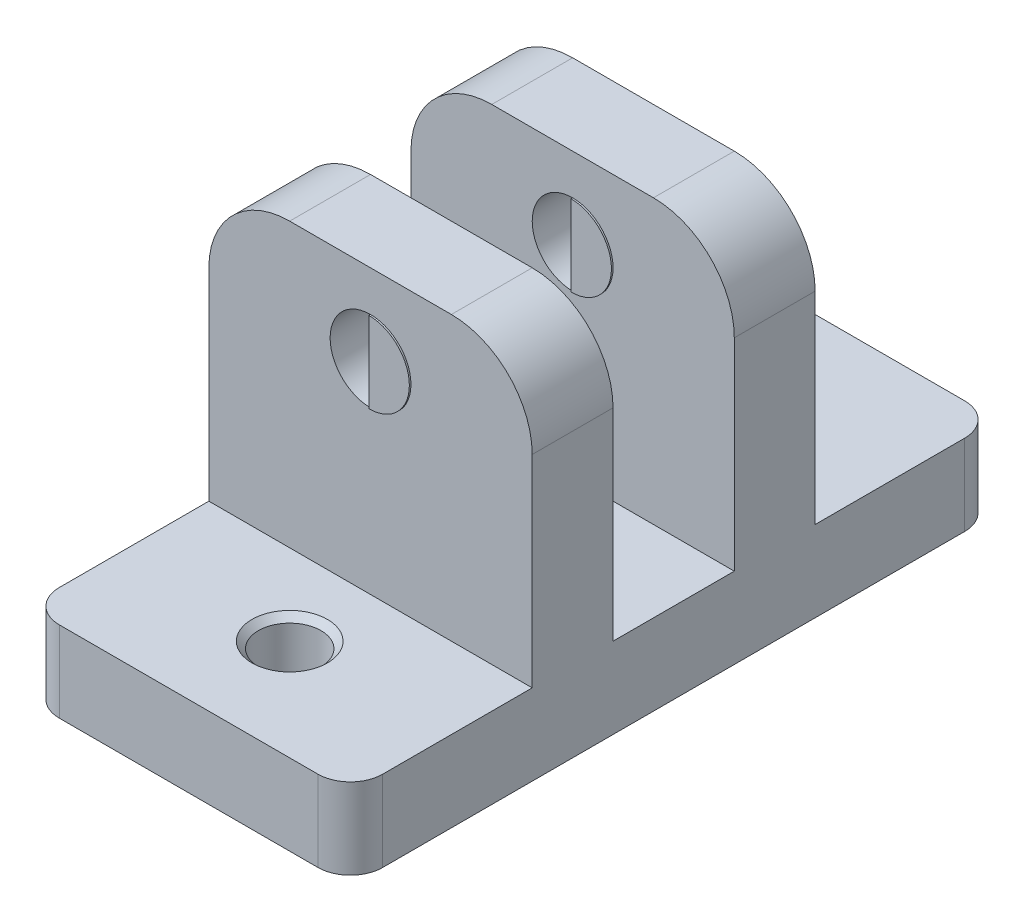
ISO-10303-21;
HEADER;
FILE_DESCRIPTION(('STEP AP214'),'2;1');
FILE_NAME('part.step','',(''),(''),'','','');
FILE_SCHEMA(('AUTOMOTIVE_DESIGN { 1 0 10303 214 1 1 1 1 }'));
ENDSEC;
DATA;
#1=APPLICATION_CONTEXT('core data for automotive mechanical design processes');
#2=APPLICATION_PROTOCOL_DEFINITION('international standard','automotive_design',2000,#1);
#3=PRODUCT_CONTEXT('',#1,'mechanical');
#4=PRODUCT('Part','Part','',(#3));
#5=PRODUCT_RELATED_PRODUCT_CATEGORY('part','',(#4));
#6=PRODUCT_DEFINITION_FORMATION('','',#4);
#7=PRODUCT_DEFINITION_CONTEXT('part definition',#1,'design');
#8=PRODUCT_DEFINITION('design','',#6,#7);
#9=PRODUCT_DEFINITION_SHAPE('','',#8);
#10=(LENGTH_UNIT() NAMED_UNIT(*) SI_UNIT(.MILLI.,.METRE.));
#11=(NAMED_UNIT(*) PLANE_ANGLE_UNIT() SI_UNIT($,.RADIAN.));
#12=(NAMED_UNIT(*) SI_UNIT($,.STERADIAN.) SOLID_ANGLE_UNIT());
#13=UNCERTAINTY_MEASURE_WITH_UNIT(LENGTH_MEASURE(1.E-05),#10,'distance_accuracy_value','');
#14=(GEOMETRIC_REPRESENTATION_CONTEXT(3) GLOBAL_UNCERTAINTY_ASSIGNED_CONTEXT((#13)) GLOBAL_UNIT_ASSIGNED_CONTEXT((#10,
#11,#12)) REPRESENTATION_CONTEXT('',''));
#15=CARTESIAN_POINT('',(0.,0.,0.));
#16=DIRECTION('',(0.,0.,1.));
#17=DIRECTION('',(1.,0.,0.));
#18=AXIS2_PLACEMENT_3D('',#15,#16,#17);
#19=CARTESIAN_POINT('',(0.,22.225,25.4));
#20=DIRECTION('',(0.,0.,-1.));
#21=DIRECTION('',(0.,1.,0.));
#22=AXIS2_PLACEMENT_3D('',#19,#20,#21);
#23=CYLINDRICAL_SURFACE('',#22,3.175);
#24=DIRECTION('',(0.,0.,-1.));
#25=VECTOR('',#24,1.);
#26=CARTESIAN_POINT('',(0.,19.05,25.4));
#27=LINE('',#26,#25);
#28=CARTESIAN_POINT('',(0.,19.05,4.7625));
#29=VERTEX_POINT('',#28);
#30=CARTESIAN_POINT('',(0.,19.05,11.1125));
#31=VERTEX_POINT('',#30);
#32=EDGE_CURVE('E12',#29,#31,#27,.F.);
#33=ORIENTED_EDGE('',*,*,#32,.F.);
#34=CARTESIAN_POINT('',(0.,22.225,4.7625));
#35=DIRECTION('',(0.,0.,1.));
#36=DIRECTION('',(0.,-1.,0.));
#37=AXIS2_PLACEMENT_3D('',#34,#35,#36);
#38=CIRCLE('',#37,3.175);
#39=CARTESIAN_POINT('',(0.,25.4,4.7625));
#40=VERTEX_POINT('',#39);
#41=EDGE_CURVE('E283',#40,#29,#38,.T.);
#42=ORIENTED_EDGE('',*,*,#41,.F.);
#43=DIRECTION('',(0.,0.,-1.));
#44=VECTOR('',#43,1.);
#45=CARTESIAN_POINT('',(0.,25.4,25.4));
#46=LINE('',#45,#44);
#47=CARTESIAN_POINT('',(0.,25.4,11.1125));
#48=VERTEX_POINT('',#47);
#49=EDGE_CURVE('E51',#48,#40,#46,.T.);
#50=ORIENTED_EDGE('',*,*,#49,.F.);
#51=CARTESIAN_POINT('',(0.,22.225,11.1125));
#52=DIRECTION('',(0.,0.,-1.));
#53=DIRECTION('',(0.,1.,0.));
#54=AXIS2_PLACEMENT_3D('',#51,#52,#53);
#55=CIRCLE('',#54,3.175);
#56=EDGE_CURVE('E58',#31,#48,#55,.T.);
#57=ORIENTED_EDGE('',*,*,#56,.F.);
#58=EDGE_LOOP('',(#33,#42,#50,#57));
#59=FACE_BOUND('',#58,.T.);
#60=ADVANCED_FACE('F43',(#59),#23,.F.);
#61=CARTESIAN_POINT('',(0.,28.575,0.));
#62=DIRECTION('',(0.,-1.,0.));
#63=DIRECTION('',(0.,0.,-1.));
#64=AXIS2_PLACEMENT_3D('',#61,#62,#63);
#65=PLANE('',#64);
#66=DIRECTION('',(1.,0.,0.));
#67=VECTOR('',#66,1.);
#68=CARTESIAN_POINT('',(-12.7,28.575,11.1125));
#69=LINE('',#68,#67);
#70=CARTESIAN_POINT('',(-6.35,28.575,11.1125));
#71=VERTEX_POINT('',#70);
#72=CARTESIAN_POINT('',(6.35,28.575,11.1125));
#73=VERTEX_POINT('',#72);
#74=EDGE_CURVE('E334',#71,#73,#69,.T.);
#75=ORIENTED_EDGE('',*,*,#74,.T.);
#76=DIRECTION('',(0.,0.,-1.));
#77=VECTOR('',#76,1.);
#78=CARTESIAN_POINT('',(6.35,28.575,0.));
#79=LINE('',#78,#77);
#80=CARTESIAN_POINT('',(6.35,28.575,4.7625));
#81=VERTEX_POINT('',#80);
#82=EDGE_CURVE('E358',#73,#81,#79,.T.);
#83=ORIENTED_EDGE('',*,*,#82,.T.);
#84=DIRECTION('',(1.,0.,0.));
#85=VECTOR('',#84,1.);
#86=CARTESIAN_POINT('',(-12.7,28.575,4.7625));
#87=LINE('',#86,#85);
#88=CARTESIAN_POINT('',(-6.35,28.575,4.7625));
#89=VERTEX_POINT('',#88);
#90=EDGE_CURVE('E297',#89,#81,#87,.T.);
#91=ORIENTED_EDGE('',*,*,#90,.F.);
#92=DIRECTION('',(0.,0.,1.));
#93=VECTOR('',#92,1.);
#94=CARTESIAN_POINT('',(-6.35,28.575,0.));
#95=LINE('',#94,#93);
#96=EDGE_CURVE('E355',#89,#71,#95,.T.);
#97=ORIENTED_EDGE('',*,*,#96,.T.);
#98=EDGE_LOOP('',(#75,#83,#91,#97));
#99=FACE_BOUND('',#98,.T.);
#100=ADVANCED_FACE('F576',(#99),#65,.F.);
#101=CARTESIAN_POINT('',(12.7,28.575,25.4));
#102=DIRECTION('',(-1.,0.,0.));
#103=DIRECTION('',(0.,0.,1.));
#104=AXIS2_PLACEMENT_3D('',#101,#102,#103);
#105=PLANE('',#104);
#106=DIRECTION('',(0.,0.,-1.));
#107=VECTOR('',#106,1.);
#108=CARTESIAN_POINT('',(12.7,6.35,25.4));
#109=LINE('',#108,#107);
#110=CARTESIAN_POINT('',(12.7,6.35,22.86));
#111=VERTEX_POINT('',#110);
#112=CARTESIAN_POINT('',(12.7,6.35,11.1125));
#113=VERTEX_POINT('',#112);
#114=EDGE_CURVE('E303',#111,#113,#109,.T.);
#115=ORIENTED_EDGE('',*,*,#114,.F.);
#116=DIRECTION('',(0.,-1.,0.));
#117=VECTOR('',#116,1.);
#118=CARTESIAN_POINT('',(12.7,28.575,22.86));
#119=LINE('',#118,#117);
#120=CARTESIAN_POINT('',(12.7,0.,22.86));
#121=VERTEX_POINT('',#120);
#122=EDGE_CURVE('E393',#111,#121,#119,.T.);
#123=ORIENTED_EDGE('',*,*,#122,.T.);
#124=DIRECTION('',(0.,0.,-1.));
#125=VECTOR('',#124,1.);
#126=CARTESIAN_POINT('',(12.7,0.,25.4));
#127=LINE('',#126,#125);
#128=CARTESIAN_POINT('',(12.7,0.,-22.86));
#129=VERTEX_POINT('',#128);
#130=EDGE_CURVE('E337',#121,#129,#127,.T.);
#131=ORIENTED_EDGE('',*,*,#130,.T.);
#132=DIRECTION('',(0.,-1.,0.));
#133=VECTOR('',#132,1.);
#134=CARTESIAN_POINT('',(12.7,28.575,-22.86));
#135=LINE('',#134,#133);
#136=CARTESIAN_POINT('',(12.7,6.35,-22.86));
#137=VERTEX_POINT('',#136);
#138=EDGE_CURVE('E391',#129,#137,#135,.F.);
#139=ORIENTED_EDGE('',*,*,#138,.T.);
#140=DIRECTION('',(0.,0.,-1.));
#141=VECTOR('',#140,1.);
#142=CARTESIAN_POINT('',(12.7,6.35,-25.4));
#143=LINE('',#142,#141);
#144=CARTESIAN_POINT('',(12.7,6.35,-11.1125));
#145=VERTEX_POINT('',#144);
#146=EDGE_CURVE('E291',#145,#137,#143,.T.);
#147=ORIENTED_EDGE('',*,*,#146,.F.);
#148=DIRECTION('',(0.,-1.,0.));
#149=VECTOR('',#148,1.);
#150=CARTESIAN_POINT('',(12.7,28.575,-11.1125));
#151=LINE('',#150,#149);
#152=CARTESIAN_POINT('',(12.7,22.225,-11.1125));
#153=VERTEX_POINT('',#152);
#154=EDGE_CURVE('E295',#153,#145,#151,.T.);
#155=ORIENTED_EDGE('',*,*,#154,.F.);
#156=DIRECTION('',(0.,0.,-1.));
#157=VECTOR('',#156,1.);
#158=CARTESIAN_POINT('',(12.7,22.225,25.4));
#159=LINE('',#158,#157);
#160=CARTESIAN_POINT('',(12.7,22.225,-4.7625));
#161=VERTEX_POINT('',#160);
#162=EDGE_CURVE('E365',#153,#161,#159,.F.);
#163=ORIENTED_EDGE('',*,*,#162,.T.);
#164=DIRECTION('',(0.,1.,0.));
#165=VECTOR('',#164,1.);
#166=CARTESIAN_POINT('',(12.7,28.575,-4.7625));
#167=LINE('',#166,#165);
#168=CARTESIAN_POINT('',(12.7,6.35,-4.7625));
#169=VERTEX_POINT('',#168);
#170=EDGE_CURVE('E481',#169,#161,#167,.T.);
#171=ORIENTED_EDGE('',*,*,#170,.F.);
#172=DIRECTION('',(0.,0.,-1.));
#173=VECTOR('',#172,1.);
#174=CARTESIAN_POINT('',(12.7,6.35,4.76249999999999));
#175=LINE('',#174,#173);
#176=CARTESIAN_POINT('',(12.7,6.35,4.76249999999999));
#177=VERTEX_POINT('',#176);
#178=EDGE_CURVE('E485',#177,#169,#175,.T.);
#179=ORIENTED_EDGE('',*,*,#178,.F.);
#180=DIRECTION('',(0.,-1.,0.));
#181=VECTOR('',#180,1.);
#182=CARTESIAN_POINT('',(12.7,28.575,4.7625));
#183=LINE('',#182,#181);
#184=CARTESIAN_POINT('',(12.7,22.225,4.7625));
#185=VERTEX_POINT('',#184);
#186=EDGE_CURVE('E287',#185,#177,#183,.T.);
#187=ORIENTED_EDGE('',*,*,#186,.F.);
#188=DIRECTION('',(0.,0.,-1.));
#189=VECTOR('',#188,1.);
#190=CARTESIAN_POINT('',(12.7,22.225,25.4));
#191=LINE('',#190,#189);
#192=CARTESIAN_POINT('',(12.7,22.225,11.1125));
#193=VERTEX_POINT('',#192);
#194=EDGE_CURVE('E367',#185,#193,#191,.F.);
#195=ORIENTED_EDGE('',*,*,#194,.T.);
#196=DIRECTION('',(0.,1.,0.));
#197=VECTOR('',#196,1.);
#198=CARTESIAN_POINT('',(12.7,28.575,11.1125));
#199=LINE('',#198,#197);
#200=EDGE_CURVE('E327',#113,#193,#199,.T.);
#201=ORIENTED_EDGE('',*,*,#200,.F.);
#202=EDGE_LOOP('',(#115,#123,#131,#139,#147,#155,#163,#171,#179,#187,#195,#201));
#203=FACE_BOUND('',#202,.T.);
#204=ADVANCED_FACE('F527',(#203),#105,.F.);
#205=CARTESIAN_POINT('',(-12.7,28.575,-25.4));
#206=DIRECTION('',(0.,0.,1.));
#207=DIRECTION('',(1.,0.,0.));
#208=AXIS2_PLACEMENT_3D('',#205,#206,#207);
#209=PLANE('',#208);
#210=DIRECTION('',(1.,0.,0.));
#211=VECTOR('',#210,1.);
#212=CARTESIAN_POINT('',(-12.7,6.35,-25.4));
#213=LINE('',#212,#211);
#214=CARTESIAN_POINT('',(-10.16,6.35,-25.4));
#215=VERTEX_POINT('',#214);
#216=CARTESIAN_POINT('',(10.16,6.35,-25.4));
#217=VERTEX_POINT('',#216);
#218=EDGE_CURVE('E300',#215,#217,#213,.T.);
#219=ORIENTED_EDGE('',*,*,#218,.T.);
#220=DIRECTION('',(0.,-1.,0.));
#221=VECTOR('',#220,1.);
#222=CARTESIAN_POINT('',(10.16,28.575,-25.4));
#223=LINE('',#222,#221);
#224=CARTESIAN_POINT('',(10.16,0.,-25.4));
#225=VERTEX_POINT('',#224);
#226=EDGE_CURVE('E415',#217,#225,#223,.T.);
#227=ORIENTED_EDGE('',*,*,#226,.T.);
#228=DIRECTION('',(-1.,0.,0.));
#229=VECTOR('',#228,1.);
#230=CARTESIAN_POINT('',(-12.7,0.,-25.4));
#231=LINE('',#230,#229);
#232=CARTESIAN_POINT('',(-10.16,0.,-25.4));
#233=VERTEX_POINT('',#232);
#234=EDGE_CURVE('E346',#225,#233,#231,.T.);
#235=ORIENTED_EDGE('',*,*,#234,.T.);
#236=DIRECTION('',(0.,-1.,0.));
#237=VECTOR('',#236,1.);
#238=CARTESIAN_POINT('',(-10.16,28.575,-25.4));
#239=LINE('',#238,#237);
#240=EDGE_CURVE('E413',#233,#215,#239,.F.);
#241=ORIENTED_EDGE('',*,*,#240,.T.);
#242=EDGE_LOOP('',(#219,#227,#235,#241));
#243=FACE_BOUND('',#242,.T.);
#244=ADVANCED_FACE('F539',(#243),#209,.F.);
#245=CARTESIAN_POINT('',(-12.7,28.575,25.4));
#246=DIRECTION('',(1.,0.,0.));
#247=DIRECTION('',(0.,0.,-1.));
#248=AXIS2_PLACEMENT_3D('',#245,#246,#247);
#249=PLANE('',#248);
#250=DIRECTION('',(0.,0.,1.));
#251=VECTOR('',#250,1.);
#252=CARTESIAN_POINT('',(-12.7,0.,25.4));
#253=LINE('',#252,#251);
#254=CARTESIAN_POINT('',(-12.7,0.,-22.86));
#255=VERTEX_POINT('',#254);
#256=CARTESIAN_POINT('',(-12.7,0.,22.86));
#257=VERTEX_POINT('',#256);
#258=EDGE_CURVE('E349',#255,#257,#253,.T.);
#259=ORIENTED_EDGE('',*,*,#258,.T.);
#260=DIRECTION('',(0.,-1.,0.));
#261=VECTOR('',#260,1.);
#262=CARTESIAN_POINT('',(-12.7,28.575,22.86));
#263=LINE('',#262,#261);
#264=CARTESIAN_POINT('',(-12.7,6.35,22.86));
#265=VERTEX_POINT('',#264);
#266=EDGE_CURVE('E425',#257,#265,#263,.F.);
#267=ORIENTED_EDGE('',*,*,#266,.T.);
#268=DIRECTION('',(0.,0.,-1.));
#269=VECTOR('',#268,1.);
#270=CARTESIAN_POINT('',(-12.7,6.35,25.4));
#271=LINE('',#270,#269);
#272=CARTESIAN_POINT('',(-12.7,6.35,11.1125));
#273=VERTEX_POINT('',#272);
#274=EDGE_CURVE('E324',#265,#273,#271,.T.);
#275=ORIENTED_EDGE('',*,*,#274,.T.);
#276=DIRECTION('',(0.,1.,0.));
#277=VECTOR('',#276,1.);
#278=CARTESIAN_POINT('',(-12.7,28.575,11.1125));
#279=LINE('',#278,#277);
#280=CARTESIAN_POINT('',(-12.7,22.225,11.1125));
#281=VERTEX_POINT('',#280);
#282=EDGE_CURVE('E326',#273,#281,#279,.T.);
#283=ORIENTED_EDGE('',*,*,#282,.T.);
#284=DIRECTION('',(0.,0.,1.));
#285=VECTOR('',#284,1.);
#286=CARTESIAN_POINT('',(-12.7,22.225,25.4));
#287=LINE('',#286,#285);
#288=CARTESIAN_POINT('',(-12.7,22.225,4.7625));
#289=VERTEX_POINT('',#288);
#290=EDGE_CURVE('E387',#281,#289,#287,.F.);
#291=ORIENTED_EDGE('',*,*,#290,.T.);
#292=DIRECTION('',(0.,-1.,0.));
#293=VECTOR('',#292,1.);
#294=CARTESIAN_POINT('',(-12.7,28.575,4.7625));
#295=LINE('',#294,#293);
#296=CARTESIAN_POINT('',(-12.7,6.35,4.76249999999999));
#297=VERTEX_POINT('',#296);
#298=EDGE_CURVE('E484',#289,#297,#295,.T.);
#299=ORIENTED_EDGE('',*,*,#298,.T.);
#300=DIRECTION('',(0.,0.,-1.));
#301=VECTOR('',#300,1.);
#302=CARTESIAN_POINT('',(-12.7,6.35,4.76249999999999));
#303=LINE('',#302,#301);
#304=CARTESIAN_POINT('',(-12.7,6.35,-4.7625));
#305=VERTEX_POINT('',#304);
#306=EDGE_CURVE('E491',#297,#305,#303,.T.);
#307=ORIENTED_EDGE('',*,*,#306,.T.);
#308=DIRECTION('',(0.,1.,0.));
#309=VECTOR('',#308,1.);
#310=CARTESIAN_POINT('',(-12.7,28.575,-4.7625));
#311=LINE('',#310,#309);
#312=CARTESIAN_POINT('',(-12.7,22.225,-4.7625));
#313=VERTEX_POINT('',#312);
#314=EDGE_CURVE('E323',#305,#313,#311,.T.);
#315=ORIENTED_EDGE('',*,*,#314,.T.);
#316=DIRECTION('',(0.,0.,1.));
#317=VECTOR('',#316,1.);
#318=CARTESIAN_POINT('',(-12.7,22.225,25.4));
#319=LINE('',#318,#317);
#320=CARTESIAN_POINT('',(-12.7,22.225,-11.1125));
#321=VERTEX_POINT('',#320);
#322=EDGE_CURVE('E389',#313,#321,#319,.F.);
#323=ORIENTED_EDGE('',*,*,#322,.T.);
#324=DIRECTION('',(0.,-1.,0.));
#325=VECTOR('',#324,1.);
#326=CARTESIAN_POINT('',(-12.7,28.575,-11.1125));
#327=LINE('',#326,#325);
#328=CARTESIAN_POINT('',(-12.7,6.35,-11.1125));
#329=VERTEX_POINT('',#328);
#330=EDGE_CURVE('E288',#321,#329,#327,.T.);
#331=ORIENTED_EDGE('',*,*,#330,.T.);
#332=DIRECTION('',(0.,0.,-1.));
#333=VECTOR('',#332,1.);
#334=CARTESIAN_POINT('',(-12.7,6.35,-25.4));
#335=LINE('',#334,#333);
#336=CARTESIAN_POINT('',(-12.7,6.35,-22.86));
#337=VERTEX_POINT('',#336);
#338=EDGE_CURVE('E290',#329,#337,#335,.T.);
#339=ORIENTED_EDGE('',*,*,#338,.T.);
#340=DIRECTION('',(0.,-1.,0.));
#341=VECTOR('',#340,1.);
#342=CARTESIAN_POINT('',(-12.7,28.575,-22.86));
#343=LINE('',#342,#341);
#344=EDGE_CURVE('E422',#337,#255,#343,.T.);
#345=ORIENTED_EDGE('',*,*,#344,.T.);
#346=EDGE_LOOP('',(#259,#267,#275,#283,#291,#299,#307,#315,#323,#331,#339,#345));
#347=FACE_BOUND('',#346,.T.);
#348=ADVANCED_FACE('F495',(#347),#249,.F.);
#349=CARTESIAN_POINT('',(-12.7,28.575,25.4));
#350=DIRECTION('',(0.,0.,-1.));
#351=DIRECTION('',(-1.,0.,0.));
#352=AXIS2_PLACEMENT_3D('',#349,#350,#351);
#353=PLANE('',#352);
#354=DIRECTION('',(1.,0.,0.));
#355=VECTOR('',#354,1.);
#356=CARTESIAN_POINT('',(-12.7,0.,25.4));
#357=LINE('',#356,#355);
#358=CARTESIAN_POINT('',(-10.16,0.,25.4));
#359=VERTEX_POINT('',#358);
#360=CARTESIAN_POINT('',(10.16,0.,25.4));
#361=VERTEX_POINT('',#360);
#362=EDGE_CURVE('E351',#359,#361,#357,.T.);
#363=ORIENTED_EDGE('',*,*,#362,.T.);
#364=DIRECTION('',(0.,-1.,0.));
#365=VECTOR('',#364,1.);
#366=CARTESIAN_POINT('',(10.16,28.575,25.4));
#367=LINE('',#366,#365);
#368=CARTESIAN_POINT('',(10.16,6.35,25.4));
#369=VERTEX_POINT('',#368);
#370=EDGE_CURVE('E407',#361,#369,#367,.F.);
#371=ORIENTED_EDGE('',*,*,#370,.T.);
#372=DIRECTION('',(1.,0.,0.));
#373=VECTOR('',#372,1.);
#374=CARTESIAN_POINT('',(-12.7,6.35,25.4));
#375=LINE('',#374,#373);
#376=CARTESIAN_POINT('',(-10.16,6.35,25.4));
#377=VERTEX_POINT('',#376);
#378=EDGE_CURVE('E330',#377,#369,#375,.T.);
#379=ORIENTED_EDGE('',*,*,#378,.F.);
#380=DIRECTION('',(0.,-1.,0.));
#381=VECTOR('',#380,1.);
#382=CARTESIAN_POINT('',(-10.16,28.575,25.4));
#383=LINE('',#382,#381);
#384=EDGE_CURVE('E404',#377,#359,#383,.T.);
#385=ORIENTED_EDGE('',*,*,#384,.T.);
#386=EDGE_LOOP('',(#363,#371,#379,#385));
#387=FACE_BOUND('',#386,.T.);
#388=ADVANCED_FACE('F560',(#387),#353,.F.);
#389=DIRECTION('',(1.,0.,0.));
#390=VECTOR('',#389,1.);
#391=CARTESIAN_POINT('',(-12.7,28.575,-4.7625));
#392=LINE('',#391,#390);
#393=CARTESIAN_POINT('',(-6.35,28.575,-4.7625));
#394=VERTEX_POINT('',#393);
#395=CARTESIAN_POINT('',(6.35,28.575,-4.7625));
#396=VERTEX_POINT('',#395);
#397=EDGE_CURVE('E317',#394,#396,#392,.T.);
#398=ORIENTED_EDGE('',*,*,#397,.T.);
#399=DIRECTION('',(0.,0.,-1.));
#400=VECTOR('',#399,1.);
#401=CARTESIAN_POINT('',(6.35,28.575,0.));
#402=LINE('',#401,#400);
#403=CARTESIAN_POINT('',(6.35,28.575,-11.1125));
#404=VERTEX_POINT('',#403);
#405=EDGE_CURVE('E376',#396,#404,#402,.T.);
#406=ORIENTED_EDGE('',*,*,#405,.T.);
#407=DIRECTION('',(1.,0.,0.));
#408=VECTOR('',#407,1.);
#409=CARTESIAN_POINT('',(-12.7,28.575,-11.1125));
#410=LINE('',#409,#408);
#411=CARTESIAN_POINT('',(-6.35,28.575,-11.1125));
#412=VERTEX_POINT('',#411);
#413=EDGE_CURVE('E294',#412,#404,#410,.T.);
#414=ORIENTED_EDGE('',*,*,#413,.F.);
#415=DIRECTION('',(0.,0.,1.));
#416=VECTOR('',#415,1.);
#417=CARTESIAN_POINT('',(-6.35,28.575,0.));
#418=LINE('',#417,#416);
#419=EDGE_CURVE('E373',#412,#394,#418,.T.);
#420=ORIENTED_EDGE('',*,*,#419,.T.);
#421=EDGE_LOOP('',(#398,#406,#414,#420));
#422=FACE_BOUND('',#421,.T.);
#423=ADVANCED_FACE('F517',(#422),#65,.F.);
#424=CARTESIAN_POINT('',(0.,0.,0.));
#425=DIRECTION('',(0.,-1.,0.));
#426=DIRECTION('',(0.,0.,-1.));
#427=AXIS2_PLACEMENT_3D('',#424,#425,#426);
#428=PLANE('',#427);
#429=CARTESIAN_POINT('',(0.,0.,-17.4625));
#430=DIRECTION('',(0.,-1.,0.));
#431=DIRECTION('',(0.,0.,-1.));
#432=AXIS2_PLACEMENT_3D('',#429,#430,#431);
#433=CIRCLE('',#432,2.96545000000001);
#434=CARTESIAN_POINT('',(0.,0.,-20.42795));
#435=VERTEX_POINT('',#434);
#436=EDGE_CURVE('E439',#435,#435,#433,.F.);
#437=ORIENTED_EDGE('',*,*,#436,.T.);
#438=EDGE_LOOP('',(#437));
#439=FACE_BOUND('',#438,.T.);
#440=CARTESIAN_POINT('',(0.,0.,17.4625));
#441=DIRECTION('',(0.,-1.,0.));
#442=DIRECTION('',(0.,0.,-1.));
#443=AXIS2_PLACEMENT_3D('',#440,#441,#442);
#444=CIRCLE('',#443,2.96544999999999);
#445=CARTESIAN_POINT('',(0.,0.,14.49705));
#446=VERTEX_POINT('',#445);
#447=EDGE_CURVE('E436',#446,#446,#444,.F.);
#448=ORIENTED_EDGE('',*,*,#447,.T.);
#449=EDGE_LOOP('',(#448));
#450=FACE_BOUND('',#449,.T.);
#451=ORIENTED_EDGE('',*,*,#130,.F.);
#452=CARTESIAN_POINT('',(10.16,0.,22.86));
#453=DIRECTION('',(0.,-1.,0.));
#454=DIRECTION('',(0.,0.,-1.));
#455=AXIS2_PLACEMENT_3D('',#452,#453,#454);
#456=CIRCLE('',#455,2.54);
#457=EDGE_CURVE('E402',#121,#361,#456,.T.);
#458=ORIENTED_EDGE('',*,*,#457,.T.);
#459=ORIENTED_EDGE('',*,*,#362,.F.);
#460=CARTESIAN_POINT('',(-10.16,0.,22.86));
#461=DIRECTION('',(0.,-1.,0.));
#462=DIRECTION('',(0.,0.,-1.));
#463=AXIS2_PLACEMENT_3D('',#460,#461,#462);
#464=CIRCLE('',#463,2.54);
#465=EDGE_CURVE('E398',#359,#257,#464,.T.);
#466=ORIENTED_EDGE('',*,*,#465,.T.);
#467=ORIENTED_EDGE('',*,*,#258,.F.);
#468=CARTESIAN_POINT('',(-10.16,0.,-22.86));
#469=DIRECTION('',(0.,-1.,0.));
#470=DIRECTION('',(0.,0.,-1.));
#471=AXIS2_PLACEMENT_3D('',#468,#469,#470);
#472=CIRCLE('',#471,2.54);
#473=EDGE_CURVE('E396',#255,#233,#472,.T.);
#474=ORIENTED_EDGE('',*,*,#473,.T.);
#475=ORIENTED_EDGE('',*,*,#234,.F.);
#476=CARTESIAN_POINT('',(10.16,0.,-22.86));
#477=DIRECTION('',(0.,-1.,0.));
#478=DIRECTION('',(0.,0.,-1.));
#479=AXIS2_PLACEMENT_3D('',#476,#477,#478);
#480=CIRCLE('',#479,2.54);
#481=EDGE_CURVE('E400',#225,#129,#480,.T.);
#482=ORIENTED_EDGE('',*,*,#481,.T.);
#483=EDGE_LOOP('',(#451,#458,#459,#466,#467,#474,#475,#482));
#484=FACE_BOUND('',#483,.T.);
#485=ADVANCED_FACE('F543',(#439,#450,#484),#428,.T.);
#486=CARTESIAN_POINT('',(-12.7,28.575,11.1125));
#487=DIRECTION('',(0.,0.,-1.));
#488=DIRECTION('',(0.,1.,0.));
#489=AXIS2_PLACEMENT_3D('',#486,#487,#488);
#490=PLANE('',#489);
#491=EDGE_CURVE('E233',#48,#31,#55,.T.);
#492=ORIENTED_EDGE('',*,*,#491,.T.);
#493=ORIENTED_EDGE('',*,*,#56,.T.);
#494=EDGE_LOOP('',(#492,#493));
#495=FACE_BOUND('',#494,.T.);
#496=ORIENTED_EDGE('',*,*,#200,.T.);
#497=CARTESIAN_POINT('',(6.35,22.225,11.1125));
#498=DIRECTION('',(0.,0.,-1.));
#499=DIRECTION('',(0.,1.,0.));
#500=AXIS2_PLACEMENT_3D('',#497,#498,#499);
#501=CIRCLE('',#500,6.35);
#502=EDGE_CURVE('E371',#193,#73,#501,.F.);
#503=ORIENTED_EDGE('',*,*,#502,.T.);
#504=ORIENTED_EDGE('',*,*,#74,.F.);
#505=CARTESIAN_POINT('',(-6.35,22.225,11.1125));
#506=DIRECTION('',(0.,0.,-1.));
#507=DIRECTION('',(0.,1.,0.));
#508=AXIS2_PLACEMENT_3D('',#505,#506,#507);
#509=CIRCLE('',#508,6.35);
#510=EDGE_CURVE('E369',#71,#281,#509,.F.);
#511=ORIENTED_EDGE('',*,*,#510,.T.);
#512=ORIENTED_EDGE('',*,*,#282,.F.);
#513=DIRECTION('',(1.,0.,0.));
#514=VECTOR('',#513,1.);
#515=CARTESIAN_POINT('',(-12.7,6.35,11.1125));
#516=LINE('',#515,#514);
#517=EDGE_CURVE('E338',#273,#113,#516,.T.);
#518=ORIENTED_EDGE('',*,*,#517,.T.);
#519=EDGE_LOOP('',(#496,#503,#504,#511,#512,#518));
#520=FACE_BOUND('',#519,.T.);
#521=ADVANCED_FACE('F570',(#495,#520),#490,.F.);
#522=CARTESIAN_POINT('',(-12.7,6.35,25.4));
#523=DIRECTION('',(0.,-1.,0.));
#524=DIRECTION('',(0.,0.,-1.));
#525=AXIS2_PLACEMENT_3D('',#522,#523,#524);
#526=PLANE('',#525);
#527=CARTESIAN_POINT('',(0.,6.35,17.4625));
#528=DIRECTION('',(0.,-1.,0.));
#529=DIRECTION('',(0.,0.,-1.));
#530=AXIS2_PLACEMENT_3D('',#527,#528,#529);
#531=CIRCLE('',#530,2.96545000000001);
#532=CARTESIAN_POINT('',(0.,6.35,14.49705));
#533=VERTEX_POINT('',#532);
#534=EDGE_CURVE('E448',#533,#533,#531,.T.);
#535=ORIENTED_EDGE('',*,*,#534,.T.);
#536=EDGE_LOOP('',(#535));
#537=FACE_BOUND('',#536,.T.);
#538=ORIENTED_EDGE('',*,*,#378,.T.);
#539=CARTESIAN_POINT('',(10.16,6.35,22.86));
#540=DIRECTION('',(0.,-1.,0.));
#541=DIRECTION('',(0.,0.,-1.));
#542=AXIS2_PLACEMENT_3D('',#539,#540,#541);
#543=CIRCLE('',#542,2.54);
#544=EDGE_CURVE('E411',#369,#111,#543,.F.);
#545=ORIENTED_EDGE('',*,*,#544,.T.);
#546=ORIENTED_EDGE('',*,*,#114,.T.);
#547=ORIENTED_EDGE('',*,*,#517,.F.);
#548=ORIENTED_EDGE('',*,*,#274,.F.);
#549=CARTESIAN_POINT('',(-10.16,6.35,22.86));
#550=DIRECTION('',(0.,-1.,0.));
#551=DIRECTION('',(0.,0.,-1.));
#552=AXIS2_PLACEMENT_3D('',#549,#550,#551);
#553=CIRCLE('',#552,2.54);
#554=EDGE_CURVE('E409',#265,#377,#553,.F.);
#555=ORIENTED_EDGE('',*,*,#554,.T.);
#556=EDGE_LOOP('',(#538,#545,#546,#547,#548,#555));
#557=FACE_BOUND('',#556,.T.);
#558=ADVANCED_FACE('F470',(#537,#557),#526,.F.);
#559=CARTESIAN_POINT('',(-12.7,28.575,4.7625));
#560=DIRECTION('',(0.,0.,1.));
#561=DIRECTION('',(0.,-1.,0.));
#562=AXIS2_PLACEMENT_3D('',#559,#560,#561);
#563=PLANE('',#562);
#564=EDGE_CURVE('E284',#29,#40,#38,.T.);
#565=ORIENTED_EDGE('',*,*,#564,.T.);
#566=ORIENTED_EDGE('',*,*,#41,.T.);
#567=EDGE_LOOP('',(#565,#566));
#568=FACE_BOUND('',#567,.T.);
#569=ORIENTED_EDGE('',*,*,#90,.T.);
#570=CARTESIAN_POINT('',(6.35,22.225,4.7625));
#571=DIRECTION('',(0.,0.,1.));
#572=DIRECTION('',(0.,-1.,0.));
#573=AXIS2_PLACEMENT_3D('',#570,#571,#572);
#574=CIRCLE('',#573,6.35);
#575=EDGE_CURVE('E363',#81,#185,#574,.F.);
#576=ORIENTED_EDGE('',*,*,#575,.T.);
#577=ORIENTED_EDGE('',*,*,#186,.T.);
#578=DIRECTION('',(1.,0.,0.));
#579=VECTOR('',#578,1.);
#580=CARTESIAN_POINT('',(-12.7,6.35,4.76249999999999));
#581=LINE('',#580,#579);
#582=EDGE_CURVE('E318',#297,#177,#581,.T.);
#583=ORIENTED_EDGE('',*,*,#582,.F.);
#584=ORIENTED_EDGE('',*,*,#298,.F.);
#585=CARTESIAN_POINT('',(-6.35,22.225,4.7625));
#586=DIRECTION('',(0.,0.,1.));
#587=DIRECTION('',(0.,-1.,0.));
#588=AXIS2_PLACEMENT_3D('',#585,#586,#587);
#589=CIRCLE('',#588,6.35);
#590=EDGE_CURVE('E361',#289,#89,#589,.F.);
#591=ORIENTED_EDGE('',*,*,#590,.T.);
#592=EDGE_LOOP('',(#569,#576,#577,#583,#584,#591));
#593=FACE_BOUND('',#592,.T.);
#594=ADVANCED_FACE('F466',(#568,#593),#563,.F.);
#595=CARTESIAN_POINT('',(-12.7,28.575,-4.7625));
#596=DIRECTION('',(0.,0.,-1.));
#597=DIRECTION('',(0.,1.,0.));
#598=AXIS2_PLACEMENT_3D('',#595,#596,#597);
#599=PLANE('',#598);
#600=CARTESIAN_POINT('',(0.,22.225,-4.7625));
#601=DIRECTION('',(0.,0.,-1.));
#602=DIRECTION('',(0.,1.,0.));
#603=AXIS2_PLACEMENT_3D('',#600,#601,#602);
#604=CIRCLE('',#603,3.175);
#605=CARTESIAN_POINT('',(0.,25.4,-4.7625));
#606=VERTEX_POINT('',#605);
#607=CARTESIAN_POINT('',(0.,19.05,-4.7625));
#608=VERTEX_POINT('',#607);
#609=EDGE_CURVE('E280',#606,#608,#604,.T.);
#610=ORIENTED_EDGE('',*,*,#609,.T.);
#611=EDGE_CURVE('E279',#608,#606,#604,.T.);
#612=ORIENTED_EDGE('',*,*,#611,.T.);
#613=EDGE_LOOP('',(#610,#612));
#614=FACE_BOUND('',#613,.T.);
#615=ORIENTED_EDGE('',*,*,#170,.T.);
#616=CARTESIAN_POINT('',(6.35,22.225,-4.7625));
#617=DIRECTION('',(0.,0.,-1.));
#618=DIRECTION('',(0.,1.,0.));
#619=AXIS2_PLACEMENT_3D('',#616,#617,#618);
#620=CIRCLE('',#619,6.35);
#621=EDGE_CURVE('E385',#161,#396,#620,.F.);
#622=ORIENTED_EDGE('',*,*,#621,.T.);
#623=ORIENTED_EDGE('',*,*,#397,.F.);
#624=CARTESIAN_POINT('',(-6.35,22.225,-4.7625));
#625=DIRECTION('',(0.,0.,-1.));
#626=DIRECTION('',(0.,1.,0.));
#627=AXIS2_PLACEMENT_3D('',#624,#625,#626);
#628=CIRCLE('',#627,6.35);
#629=EDGE_CURVE('E383',#394,#313,#628,.F.);
#630=ORIENTED_EDGE('',*,*,#629,.T.);
#631=ORIENTED_EDGE('',*,*,#314,.F.);
#632=DIRECTION('',(1.,0.,0.));
#633=VECTOR('',#632,1.);
#634=CARTESIAN_POINT('',(-12.7,6.35,-4.7625));
#635=LINE('',#634,#633);
#636=EDGE_CURVE('E314',#305,#169,#635,.T.);
#637=ORIENTED_EDGE('',*,*,#636,.T.);
#638=EDGE_LOOP('',(#615,#622,#623,#630,#631,#637));
#639=FACE_BOUND('',#638,.T.);
#640=ADVANCED_FACE('F469',(#614,#639),#599,.F.);
#641=CARTESIAN_POINT('',(-12.7,6.35,4.76249999999999));
#642=DIRECTION('',(0.,-1.,0.));
#643=DIRECTION('',(0.,0.,-1.));
#644=AXIS2_PLACEMENT_3D('',#641,#642,#643);
#645=PLANE('',#644);
#646=ORIENTED_EDGE('',*,*,#178,.T.);
#647=ORIENTED_EDGE('',*,*,#636,.F.);
#648=ORIENTED_EDGE('',*,*,#306,.F.);
#649=ORIENTED_EDGE('',*,*,#582,.T.);
#650=EDGE_LOOP('',(#646,#647,#648,#649));
#651=FACE_BOUND('',#650,.T.);
#652=ADVANCED_FACE('F500',(#651),#645,.F.);
#653=CARTESIAN_POINT('',(-12.7,6.35,-25.4));
#654=DIRECTION('',(0.,-1.,0.));
#655=DIRECTION('',(0.,0.,-1.));
#656=AXIS2_PLACEMENT_3D('',#653,#654,#655);
#657=PLANE('',#656);
#658=CARTESIAN_POINT('',(0.,6.35,-17.4625));
#659=DIRECTION('',(0.,-1.,0.));
#660=DIRECTION('',(0.,0.,-1.));
#661=AXIS2_PLACEMENT_3D('',#658,#659,#660);
#662=CIRCLE('',#661,2.96545000000001);
#663=CARTESIAN_POINT('',(0.,6.35,-20.42795));
#664=VERTEX_POINT('',#663);
#665=EDGE_CURVE('E433',#664,#664,#662,.T.);
#666=ORIENTED_EDGE('',*,*,#665,.T.);
#667=EDGE_LOOP('',(#666));
#668=FACE_BOUND('',#667,.T.);
#669=ORIENTED_EDGE('',*,*,#146,.T.);
#670=CARTESIAN_POINT('',(10.16,6.35,-22.86));
#671=DIRECTION('',(0.,-1.,0.));
#672=DIRECTION('',(0.,0.,-1.));
#673=AXIS2_PLACEMENT_3D('',#670,#671,#672);
#674=CIRCLE('',#673,2.54);
#675=EDGE_CURVE('E420',#137,#217,#674,.F.);
#676=ORIENTED_EDGE('',*,*,#675,.T.);
#677=ORIENTED_EDGE('',*,*,#218,.F.);
#678=CARTESIAN_POINT('',(-10.16,6.35,-22.86));
#679=DIRECTION('',(0.,-1.,0.));
#680=DIRECTION('',(0.,0.,-1.));
#681=AXIS2_PLACEMENT_3D('',#678,#679,#680);
#682=CIRCLE('',#681,2.54);
#683=EDGE_CURVE('E418',#215,#337,#682,.F.);
#684=ORIENTED_EDGE('',*,*,#683,.T.);
#685=ORIENTED_EDGE('',*,*,#338,.F.);
#686=DIRECTION('',(1.,0.,0.));
#687=VECTOR('',#686,1.);
#688=CARTESIAN_POINT('',(-12.7,6.35,-11.1125));
#689=LINE('',#688,#687);
#690=EDGE_CURVE('E304',#329,#145,#689,.T.);
#691=ORIENTED_EDGE('',*,*,#690,.T.);
#692=EDGE_LOOP('',(#669,#676,#677,#684,#685,#691));
#693=FACE_BOUND('',#692,.T.);
#694=ADVANCED_FACE('F531',(#668,#693),#657,.F.);
#695=CARTESIAN_POINT('',(-12.7,28.575,-11.1125));
#696=DIRECTION('',(0.,0.,1.));
#697=DIRECTION('',(0.,-1.,0.));
#698=AXIS2_PLACEMENT_3D('',#695,#696,#697);
#699=PLANE('',#698);
#700=CARTESIAN_POINT('',(0.,22.225,-11.1125));
#701=DIRECTION('',(0.,0.,-1.));
#702=DIRECTION('',(0.,1.,0.));
#703=AXIS2_PLACEMENT_3D('',#700,#701,#702);
#704=CIRCLE('',#703,3.175);
#705=CARTESIAN_POINT('',(0.,25.4,-11.1125));
#706=VERTEX_POINT('',#705);
#707=CARTESIAN_POINT('',(0.,19.05,-11.1125));
#708=VERTEX_POINT('',#707);
#709=EDGE_CURVE('E276',#706,#708,#704,.T.);
#710=ORIENTED_EDGE('',*,*,#709,.F.);
#711=EDGE_CURVE('E271',#708,#706,#704,.T.);
#712=ORIENTED_EDGE('',*,*,#711,.F.);
#713=EDGE_LOOP('',(#710,#712));
#714=FACE_BOUND('',#713,.T.);
#715=ORIENTED_EDGE('',*,*,#413,.T.);
#716=CARTESIAN_POINT('',(6.35,22.225,-11.1125));
#717=DIRECTION('',(0.,0.,1.));
#718=DIRECTION('',(0.,-1.,0.));
#719=AXIS2_PLACEMENT_3D('',#716,#717,#718);
#720=CIRCLE('',#719,6.35);
#721=EDGE_CURVE('E381',#404,#153,#720,.F.);
#722=ORIENTED_EDGE('',*,*,#721,.T.);
#723=ORIENTED_EDGE('',*,*,#154,.T.);
#724=ORIENTED_EDGE('',*,*,#690,.F.);
#725=ORIENTED_EDGE('',*,*,#330,.F.);
#726=CARTESIAN_POINT('',(-6.35,22.225,-11.1125));
#727=DIRECTION('',(0.,0.,1.));
#728=DIRECTION('',(0.,-1.,0.));
#729=AXIS2_PLACEMENT_3D('',#726,#727,#728);
#730=CIRCLE('',#729,6.35);
#731=EDGE_CURVE('E379',#321,#412,#730,.F.);
#732=ORIENTED_EDGE('',*,*,#731,.T.);
#733=EDGE_LOOP('',(#715,#722,#723,#724,#725,#732));
#734=FACE_BOUND('',#733,.T.);
#735=ADVANCED_FACE('F514',(#714,#734),#699,.F.);
#736=CARTESIAN_POINT('',(0.,6.35,-17.4625));
#737=DIRECTION('',(0.,1.,0.));
#738=DIRECTION('',(0.,0.,1.));
#739=AXIS2_PLACEMENT_3D('',#736,#737,#738);
#740=CYLINDRICAL_SURFACE('',#739,2.45745);
#741=CARTESIAN_POINT('',(0.,5.842,-17.4625));
#742=DIRECTION('',(0.,-1.,0.));
#743=DIRECTION('',(0.,0.,-1.));
#744=AXIS2_PLACEMENT_3D('',#741,#742,#743);
#745=CIRCLE('',#744,2.45745);
#746=CARTESIAN_POINT('',(0.,5.842,-19.91995));
#747=VERTEX_POINT('',#746);
#748=EDGE_CURVE('E430',#747,#747,#745,.F.);
#749=ORIENTED_EDGE('',*,*,#748,.T.);
#750=EDGE_LOOP('',(#749));
#751=FACE_BOUND('',#750,.T.);
#752=CARTESIAN_POINT('',(0.,0.508000000000013,-17.4625));
#753=DIRECTION('',(0.,-1.,0.));
#754=DIRECTION('',(0.,0.,-1.));
#755=AXIS2_PLACEMENT_3D('',#752,#753,#754);
#756=CIRCLE('',#755,2.45745);
#757=CARTESIAN_POINT('',(0.,0.508000000000013,-19.91995));
#758=VERTEX_POINT('',#757);
#759=EDGE_CURVE('E427',#758,#758,#756,.T.);
#760=ORIENTED_EDGE('',*,*,#759,.T.);
#761=EDGE_LOOP('',(#760));
#762=FACE_BOUND('',#761,.T.);
#763=ADVANCED_FACE('F604',(#751,#762),#740,.F.);
#764=CARTESIAN_POINT('',(0.,6.34999999999999,17.4625));
#765=DIRECTION('',(0.,1.,0.));
#766=DIRECTION('',(0.,0.,1.));
#767=AXIS2_PLACEMENT_3D('',#764,#765,#766);
#768=CYLINDRICAL_SURFACE('',#767,2.45745);
#769=CARTESIAN_POINT('',(0.,5.84199999999999,17.4625));
#770=DIRECTION('',(0.,-1.,0.));
#771=DIRECTION('',(0.,0.,-1.));
#772=AXIS2_PLACEMENT_3D('',#769,#770,#771);
#773=CIRCLE('',#772,2.45745);
#774=CARTESIAN_POINT('',(0.,5.84199999999999,15.00505));
#775=VERTEX_POINT('',#774);
#776=EDGE_CURVE('E445',#775,#775,#773,.F.);
#777=ORIENTED_EDGE('',*,*,#776,.T.);
#778=EDGE_LOOP('',(#777));
#779=FACE_BOUND('',#778,.T.);
#780=CARTESIAN_POINT('',(0.,0.508000000000002,17.4625));
#781=DIRECTION('',(0.,-1.,0.));
#782=DIRECTION('',(0.,0.,-1.));
#783=AXIS2_PLACEMENT_3D('',#780,#781,#782);
#784=CIRCLE('',#783,2.45745);
#785=CARTESIAN_POINT('',(0.,0.508000000000002,15.00505));
#786=VERTEX_POINT('',#785);
#787=EDGE_CURVE('E442',#786,#786,#784,.T.);
#788=ORIENTED_EDGE('',*,*,#787,.T.);
#789=EDGE_LOOP('',(#788));
#790=FACE_BOUND('',#789,.T.);
#791=ADVANCED_FACE('F597',(#779,#790),#768,.F.);
#792=ORIENTED_EDGE('',*,*,#711,.T.);
#793=DIRECTION('',(0.,0.,-1.));
#794=VECTOR('',#793,1.);
#795=CARTESIAN_POINT('',(0.,25.4,25.4));
#796=LINE('',#795,#794);
#797=EDGE_CURVE('E454',#706,#606,#796,.F.);
#798=ORIENTED_EDGE('',*,*,#797,.T.);
#799=ORIENTED_EDGE('',*,*,#611,.F.);
#800=DIRECTION('',(0.,0.,-1.));
#801=VECTOR('',#800,1.);
#802=CARTESIAN_POINT('',(0.,19.05,25.4));
#803=LINE('',#802,#801);
#804=EDGE_CURVE('E451',#608,#708,#803,.T.);
#805=ORIENTED_EDGE('',*,*,#804,.T.);
#806=EDGE_LOOP('',(#792,#798,#799,#805));
#807=FACE_BOUND('',#806,.T.);
#808=ADVANCED_FACE('F589',(#807),#23,.F.);
#809=CARTESIAN_POINT('',(6.35,22.225,0.));
#810=DIRECTION('',(0.,0.,-1.));
#811=DIRECTION('',(-1.,0.,0.));
#812=AXIS2_PLACEMENT_3D('',#809,#810,#811);
#813=CYLINDRICAL_SURFACE('',#812,6.35);
#814=ORIENTED_EDGE('',*,*,#502,.F.);
#815=ORIENTED_EDGE('',*,*,#194,.F.);
#816=ORIENTED_EDGE('',*,*,#575,.F.);
#817=ORIENTED_EDGE('',*,*,#82,.F.);
#818=EDGE_LOOP('',(#814,#815,#816,#817));
#819=FACE_BOUND('',#818,.T.);
#820=ADVANCED_FACE('F575',(#819),#813,.T.);
#821=CARTESIAN_POINT('',(6.35,22.225,0.));
#822=DIRECTION('',(0.,0.,-1.));
#823=DIRECTION('',(-1.,0.,0.));
#824=AXIS2_PLACEMENT_3D('',#821,#822,#823);
#825=CYLINDRICAL_SURFACE('',#824,6.35);
#826=ORIENTED_EDGE('',*,*,#621,.F.);
#827=ORIENTED_EDGE('',*,*,#162,.F.);
#828=ORIENTED_EDGE('',*,*,#721,.F.);
#829=ORIENTED_EDGE('',*,*,#405,.F.);
#830=EDGE_LOOP('',(#826,#827,#828,#829));
#831=FACE_BOUND('',#830,.T.);
#832=ADVANCED_FACE('F521',(#831),#825,.T.);
#833=CARTESIAN_POINT('',(-6.35,22.225,0.));
#834=DIRECTION('',(0.,0.,1.));
#835=DIRECTION('',(1.,0.,0.));
#836=AXIS2_PLACEMENT_3D('',#833,#834,#835);
#837=CYLINDRICAL_SURFACE('',#836,6.35);
#838=ORIENTED_EDGE('',*,*,#731,.F.);
#839=ORIENTED_EDGE('',*,*,#322,.F.);
#840=ORIENTED_EDGE('',*,*,#629,.F.);
#841=ORIENTED_EDGE('',*,*,#419,.F.);
#842=EDGE_LOOP('',(#838,#839,#840,#841));
#843=FACE_BOUND('',#842,.T.);
#844=ADVANCED_FACE('F509',(#843),#837,.T.);
#845=CARTESIAN_POINT('',(-6.35,22.225,0.));
#846=DIRECTION('',(0.,0.,1.));
#847=DIRECTION('',(1.,0.,0.));
#848=AXIS2_PLACEMENT_3D('',#845,#846,#847);
#849=CYLINDRICAL_SURFACE('',#848,6.35);
#850=ORIENTED_EDGE('',*,*,#590,.F.);
#851=ORIENTED_EDGE('',*,*,#290,.F.);
#852=ORIENTED_EDGE('',*,*,#510,.F.);
#853=ORIENTED_EDGE('',*,*,#96,.F.);
#854=EDGE_LOOP('',(#850,#851,#852,#853));
#855=FACE_BOUND('',#854,.T.);
#856=ADVANCED_FACE('F578',(#855),#849,.T.);
#857=CARTESIAN_POINT('',(10.16,28.575,22.86));
#858=DIRECTION('',(0.,-1.,0.));
#859=DIRECTION('',(0.,0.,-1.));
#860=AXIS2_PLACEMENT_3D('',#857,#858,#859);
#861=CYLINDRICAL_SURFACE('',#860,2.54);
#862=ORIENTED_EDGE('',*,*,#544,.F.);
#863=ORIENTED_EDGE('',*,*,#370,.F.);
#864=ORIENTED_EDGE('',*,*,#457,.F.);
#865=ORIENTED_EDGE('',*,*,#122,.F.);
#866=EDGE_LOOP('',(#862,#863,#864,#865));
#867=FACE_BOUND('',#866,.T.);
#868=ADVANCED_FACE('F564',(#867),#861,.T.);
#869=CARTESIAN_POINT('',(10.16,28.575,-22.86));
#870=DIRECTION('',(0.,-1.,0.));
#871=DIRECTION('',(0.,0.,-1.));
#872=AXIS2_PLACEMENT_3D('',#869,#870,#871);
#873=CYLINDRICAL_SURFACE('',#872,2.54);
#874=ORIENTED_EDGE('',*,*,#675,.F.);
#875=ORIENTED_EDGE('',*,*,#138,.F.);
#876=ORIENTED_EDGE('',*,*,#481,.F.);
#877=ORIENTED_EDGE('',*,*,#226,.F.);
#878=EDGE_LOOP('',(#874,#875,#876,#877));
#879=FACE_BOUND('',#878,.T.);
#880=ADVANCED_FACE('F536',(#879),#873,.T.);
#881=CARTESIAN_POINT('',(-10.16,28.575,22.86));
#882=DIRECTION('',(0.,-1.,0.));
#883=DIRECTION('',(0.,0.,-1.));
#884=AXIS2_PLACEMENT_3D('',#881,#882,#883);
#885=CYLINDRICAL_SURFACE('',#884,2.54);
#886=ORIENTED_EDGE('',*,*,#554,.F.);
#887=ORIENTED_EDGE('',*,*,#266,.F.);
#888=ORIENTED_EDGE('',*,*,#465,.F.);
#889=ORIENTED_EDGE('',*,*,#384,.F.);
#890=EDGE_LOOP('',(#886,#887,#888,#889));
#891=FACE_BOUND('',#890,.T.);
#892=ADVANCED_FACE('F553',(#891),#885,.T.);
#893=CARTESIAN_POINT('',(-10.16,28.575,-22.86));
#894=DIRECTION('',(0.,-1.,0.));
#895=DIRECTION('',(0.,0.,-1.));
#896=AXIS2_PLACEMENT_3D('',#893,#894,#895);
#897=CYLINDRICAL_SURFACE('',#896,2.54);
#898=ORIENTED_EDGE('',*,*,#683,.F.);
#899=ORIENTED_EDGE('',*,*,#240,.F.);
#900=ORIENTED_EDGE('',*,*,#473,.F.);
#901=ORIENTED_EDGE('',*,*,#344,.F.);
#902=EDGE_LOOP('',(#898,#899,#900,#901));
#903=FACE_BOUND('',#902,.T.);
#904=ADVANCED_FACE('F548',(#903),#897,.T.);
#905=CARTESIAN_POINT('',(0.,5.842,-17.4625));
#906=DIRECTION('',(0.,1.,0.));
#907=DIRECTION('',(0.,0.,1.));
#908=AXIS2_PLACEMENT_3D('',#905,#906,#907);
#909=CONICAL_SURFACE('',#908,2.45745,0.785398163397455);
#910=ORIENTED_EDGE('',*,*,#665,.F.);
#911=EDGE_LOOP('',(#910));
#912=FACE_BOUND('',#911,.T.);
#913=ORIENTED_EDGE('',*,*,#748,.F.);
#914=EDGE_LOOP('',(#913));
#915=FACE_BOUND('',#914,.T.);
#916=ADVANCED_FACE('F739',(#912,#915),#909,.F.);
#917=CARTESIAN_POINT('',(0.,0.,-17.4625));
#918=DIRECTION('',(0.,-1.,0.));
#919=DIRECTION('',(0.,0.,-1.));
#920=AXIS2_PLACEMENT_3D('',#917,#918,#919);
#921=CONICAL_SURFACE('',#920,2.96545000000001,0.785398163397445);
#922=ORIENTED_EDGE('',*,*,#759,.F.);
#923=EDGE_LOOP('',(#922));
#924=FACE_BOUND('',#923,.T.);
#925=ORIENTED_EDGE('',*,*,#436,.F.);
#926=EDGE_LOOP('',(#925));
#927=FACE_BOUND('',#926,.T.);
#928=ADVANCED_FACE('F646',(#924,#927),#921,.F.);
#929=CARTESIAN_POINT('',(0.,5.84199999999999,17.4625));
#930=DIRECTION('',(0.,1.,0.));
#931=DIRECTION('',(0.,0.,1.));
#932=AXIS2_PLACEMENT_3D('',#929,#930,#931);
#933=CONICAL_SURFACE('',#932,2.45745,0.785398163397455);
#934=ORIENTED_EDGE('',*,*,#534,.F.);
#935=EDGE_LOOP('',(#934));
#936=FACE_BOUND('',#935,.T.);
#937=ORIENTED_EDGE('',*,*,#776,.F.);
#938=EDGE_LOOP('',(#937));
#939=FACE_BOUND('',#938,.T.);
#940=ADVANCED_FACE('F641',(#936,#939),#933,.F.);
#941=CARTESIAN_POINT('',(0.,0.,17.4625));
#942=DIRECTION('',(0.,-1.,0.));
#943=DIRECTION('',(0.,0.,-1.));
#944=AXIS2_PLACEMENT_3D('',#941,#942,#943);
#945=CONICAL_SURFACE('',#944,2.96544999999999,0.785398163397442);
#946=ORIENTED_EDGE('',*,*,#787,.F.);
#947=EDGE_LOOP('',(#946));
#948=FACE_BOUND('',#947,.T.);
#949=ORIENTED_EDGE('',*,*,#447,.F.);
#950=EDGE_LOOP('',(#949));
#951=FACE_BOUND('',#950,.T.);
#952=ADVANCED_FACE('F45',(#948,#951),#945,.F.);
#953=CARTESIAN_POINT('',(0.,22.225,-4.6355));
#954=DIRECTION('',(0.,0.,-1.));
#955=DIRECTION('',(0.,1.,0.));
#956=AXIS2_PLACEMENT_3D('',#953,#954,#955);
#957=CYLINDRICAL_SURFACE('',#956,3.175);
#958=ORIENTED_EDGE('',*,*,#609,.F.);
#959=DIRECTION('',(0.,0.,-1.));
#960=VECTOR('',#959,1.);
#961=CARTESIAN_POINT('',(0.,25.4,-4.6355));
#962=LINE('',#961,#960);
#963=CARTESIAN_POINT('',(0.,25.4,-4.6355));
#964=VERTEX_POINT('',#963);
#965=EDGE_CURVE('E268',#964,#606,#962,.T.);
#966=ORIENTED_EDGE('',*,*,#965,.F.);
#967=CARTESIAN_POINT('',(0.,22.225,-4.6355));
#968=DIRECTION('',(0.,0.,-1.));
#969=DIRECTION('',(0.,1.,0.));
#970=AXIS2_PLACEMENT_3D('',#967,#968,#969);
#971=CIRCLE('',#970,3.175);
#972=CARTESIAN_POINT('',(0.,19.05,-4.6355));
#973=VERTEX_POINT('',#972);
#974=EDGE_CURVE('E261',#964,#973,#971,.T.);
#975=ORIENTED_EDGE('',*,*,#974,.T.);
#976=DIRECTION('',(0.,0.,-1.));
#977=VECTOR('',#976,1.);
#978=CARTESIAN_POINT('',(0.,19.05,-4.6355));
#979=LINE('',#978,#977);
#980=EDGE_CURVE('E273',#973,#608,#979,.T.);
#981=ORIENTED_EDGE('',*,*,#980,.T.);
#982=EDGE_LOOP('',(#958,#966,#975,#981));
#983=FACE_BOUND('',#982,.T.);
#984=ADVANCED_FACE('F622',(#983),#957,.T.);
#985=ORIENTED_EDGE('',*,*,#709,.T.);
#986=CARTESIAN_POINT('',(0.,19.05,-11.2395));
#987=VERTEX_POINT('',#986);
#988=EDGE_CURVE('E267',#708,#987,#979,.T.);
#989=ORIENTED_EDGE('',*,*,#988,.T.);
#990=CARTESIAN_POINT('',(0.,22.225,-11.2395));
#991=DIRECTION('',(0.,0.,-1.));
#992=DIRECTION('',(0.,1.,0.));
#993=AXIS2_PLACEMENT_3D('',#990,#991,#992);
#994=CIRCLE('',#993,3.175);
#995=CARTESIAN_POINT('',(0.,25.4,-11.2395));
#996=VERTEX_POINT('',#995);
#997=EDGE_CURVE('E253',#996,#987,#994,.T.);
#998=ORIENTED_EDGE('',*,*,#997,.F.);
#999=EDGE_CURVE('E272',#706,#996,#962,.T.);
#1000=ORIENTED_EDGE('',*,*,#999,.F.);
#1001=EDGE_LOOP('',(#985,#989,#998,#1000));
#1002=FACE_BOUND('',#1001,.T.);
#1003=ADVANCED_FACE('F614',(#1002),#957,.T.);
#1004=CARTESIAN_POINT('',(0.,25.4,-4.6355));
#1005=DIRECTION('',(-1.,0.,0.));
#1006=DIRECTION('',(0.,0.,1.));
#1007=AXIS2_PLACEMENT_3D('',#1004,#1005,#1006);
#1008=PLANE('',#1007);
#1009=ORIENTED_EDGE('',*,*,#965,.T.);
#1010=ORIENTED_EDGE('',*,*,#797,.F.);
#1011=ORIENTED_EDGE('',*,*,#999,.T.);
#1012=DIRECTION('',(0.,1.,0.));
#1013=VECTOR('',#1012,1.);
#1014=CARTESIAN_POINT('',(0.,25.4,-11.2395));
#1015=LINE('',#1014,#1013);
#1016=EDGE_CURVE('E258',#987,#996,#1015,.T.);
#1017=ORIENTED_EDGE('',*,*,#1016,.F.);
#1018=ORIENTED_EDGE('',*,*,#988,.F.);
#1019=ORIENTED_EDGE('',*,*,#804,.F.);
#1020=ORIENTED_EDGE('',*,*,#980,.F.);
#1021=DIRECTION('',(0.,1.,0.));
#1022=VECTOR('',#1021,1.);
#1023=CARTESIAN_POINT('',(0.,25.4,-4.6355));
#1024=LINE('',#1023,#1022);
#1025=EDGE_CURVE('E264',#973,#964,#1024,.T.);
#1026=ORIENTED_EDGE('',*,*,#1025,.T.);
#1027=EDGE_LOOP('',(#1009,#1010,#1011,#1017,#1018,#1019,#1020,#1026));
#1028=FACE_BOUND('',#1027,.T.);
#1029=ADVANCED_FACE('F618',(#1028),#1008,.T.);
#1030=CARTESIAN_POINT('',(0.,22.225,-4.6355));
#1031=DIRECTION('',(0.,0.,-1.));
#1032=DIRECTION('',(0.,1.,0.));
#1033=AXIS2_PLACEMENT_3D('',#1030,#1031,#1032);
#1034=PLANE('',#1033);
#1035=ORIENTED_EDGE('',*,*,#974,.F.);
#1036=ORIENTED_EDGE('',*,*,#1025,.F.);
#1037=EDGE_LOOP('',(#1035,#1036));
#1038=FACE_BOUND('',#1037,.T.);
#1039=ADVANCED_FACE('F624',(#1038),#1034,.F.);
#1040=CARTESIAN_POINT('',(0.,22.225,-11.2395));
#1041=DIRECTION('',(0.,0.,-1.));
#1042=DIRECTION('',(0.,1.,0.));
#1043=AXIS2_PLACEMENT_3D('',#1040,#1041,#1042);
#1044=PLANE('',#1043);
#1045=ORIENTED_EDGE('',*,*,#997,.T.);
#1046=ORIENTED_EDGE('',*,*,#1016,.T.);
#1047=EDGE_LOOP('',(#1045,#1046));
#1048=FACE_BOUND('',#1047,.T.);
#1049=ADVANCED_FACE('F626',(#1048),#1044,.T.);
#1050=CARTESIAN_POINT('',(0.,22.225,4.6355));
#1051=DIRECTION('',(0.,0.,1.));
#1052=DIRECTION('',(0.,-1.,0.));
#1053=AXIS2_PLACEMENT_3D('',#1050,#1051,#1052);
#1054=CYLINDRICAL_SURFACE('',#1053,3.175);
#1055=DIRECTION('',(0.,0.,1.));
#1056=VECTOR('',#1055,1.);
#1057=CARTESIAN_POINT('',(0.,19.05,4.6355));
#1058=LINE('',#1057,#1056);
#1059=CARTESIAN_POINT('',(0.,19.05,11.2395));
#1060=VERTEX_POINT('',#1059);
#1061=EDGE_CURVE('E245',#31,#1060,#1058,.T.);
#1062=ORIENTED_EDGE('',*,*,#1061,.F.);
#1063=ORIENTED_EDGE('',*,*,#491,.F.);
#1064=DIRECTION('',(0.,0.,1.));
#1065=VECTOR('',#1064,1.);
#1066=CARTESIAN_POINT('',(0.,25.4,4.6355));
#1067=LINE('',#1066,#1065);
#1068=CARTESIAN_POINT('',(0.,25.4,11.2395));
#1069=VERTEX_POINT('',#1068);
#1070=EDGE_CURVE('E227',#48,#1069,#1067,.T.);
#1071=ORIENTED_EDGE('',*,*,#1070,.T.);
#1072=CARTESIAN_POINT('',(0.,22.225,11.2395));
#1073=DIRECTION('',(0.,0.,-1.));
#1074=DIRECTION('',(0.,1.,0.));
#1075=AXIS2_PLACEMENT_3D('',#1072,#1073,#1074);
#1076=CIRCLE('',#1075,3.175);
#1077=EDGE_CURVE('E231',#1069,#1060,#1076,.T.);
#1078=ORIENTED_EDGE('',*,*,#1077,.T.);
#1079=EDGE_LOOP('',(#1062,#1063,#1071,#1078));
#1080=FACE_BOUND('',#1079,.T.);
#1081=ADVANCED_FACE('F230',(#1080),#1054,.T.);
#1082=CARTESIAN_POINT('',(0.,25.4,4.6355));
#1083=VERTEX_POINT('',#1082);
#1084=EDGE_CURVE('E236',#1083,#40,#1067,.T.);
#1085=ORIENTED_EDGE('',*,*,#1084,.T.);
#1086=ORIENTED_EDGE('',*,*,#564,.F.);
#1087=CARTESIAN_POINT('',(0.,19.05,4.6355));
#1088=VERTEX_POINT('',#1087);
#1089=EDGE_CURVE('E252',#1088,#29,#1058,.T.);
#1090=ORIENTED_EDGE('',*,*,#1089,.F.);
#1091=CARTESIAN_POINT('',(0.,22.225,4.6355));
#1092=DIRECTION('',(0.,0.,-1.));
#1093=DIRECTION('',(0.,1.,0.));
#1094=AXIS2_PLACEMENT_3D('',#1091,#1092,#1093);
#1095=CIRCLE('',#1094,3.175);
#1096=EDGE_CURVE('E246',#1083,#1088,#1095,.T.);
#1097=ORIENTED_EDGE('',*,*,#1096,.F.);
#1098=EDGE_LOOP('',(#1085,#1086,#1090,#1097));
#1099=FACE_BOUND('',#1098,.T.);
#1100=ADVANCED_FACE('F460',(#1099),#1054,.T.);
#1101=CARTESIAN_POINT('',(0.,25.4,4.6355));
#1102=DIRECTION('',(1.,0.,0.));
#1103=DIRECTION('',(0.,0.,-1.));
#1104=AXIS2_PLACEMENT_3D('',#1101,#1102,#1103);
#1105=PLANE('',#1104);
#1106=ORIENTED_EDGE('',*,*,#1089,.T.);
#1107=ORIENTED_EDGE('',*,*,#32,.T.);
#1108=ORIENTED_EDGE('',*,*,#1061,.T.);
#1109=DIRECTION('',(0.,1.,0.));
#1110=VECTOR('',#1109,1.);
#1111=CARTESIAN_POINT('',(0.,25.4,11.2395));
#1112=LINE('',#1111,#1110);
#1113=EDGE_CURVE('E241',#1060,#1069,#1112,.T.);
#1114=ORIENTED_EDGE('',*,*,#1113,.T.);
#1115=ORIENTED_EDGE('',*,*,#1070,.F.);
#1116=ORIENTED_EDGE('',*,*,#49,.T.);
#1117=ORIENTED_EDGE('',*,*,#1084,.F.);
#1118=DIRECTION('',(0.,1.,0.));
#1119=VECTOR('',#1118,1.);
#1120=CARTESIAN_POINT('',(0.,25.4,4.6355));
#1121=LINE('',#1120,#1119);
#1122=EDGE_CURVE('E237',#1088,#1083,#1121,.T.);
#1123=ORIENTED_EDGE('',*,*,#1122,.F.);
#1124=EDGE_LOOP('',(#1106,#1107,#1108,#1114,#1115,#1116,#1117,#1123));
#1125=FACE_BOUND('',#1124,.T.);
#1126=ADVANCED_FACE('F244',(#1125),#1105,.F.);
#1127=CARTESIAN_POINT('',(0.,22.225,4.6355));
#1128=DIRECTION('',(0.,0.,1.));
#1129=DIRECTION('',(0.,1.,0.));
#1130=AXIS2_PLACEMENT_3D('',#1127,#1128,#1129);
#1131=PLANE('',#1130);
#1132=ORIENTED_EDGE('',*,*,#1096,.T.);
#1133=ORIENTED_EDGE('',*,*,#1122,.T.);
#1134=EDGE_LOOP('',(#1132,#1133));
#1135=FACE_BOUND('',#1134,.T.);
#1136=ADVANCED_FACE('F463',(#1135),#1131,.F.);
#1137=CARTESIAN_POINT('',(0.,22.225,11.2395));
#1138=DIRECTION('',(0.,0.,1.));
#1139=DIRECTION('',(0.,1.,0.));
#1140=AXIS2_PLACEMENT_3D('',#1137,#1138,#1139);
#1141=PLANE('',#1140);
#1142=ORIENTED_EDGE('',*,*,#1077,.F.);
#1143=ORIENTED_EDGE('',*,*,#1113,.F.);
#1144=EDGE_LOOP('',(#1142,#1143));
#1145=FACE_BOUND('',#1144,.T.);
#1146=ADVANCED_FACE('F240',(#1145),#1141,.T.);
#1147=CLOSED_SHELL('',(#60,#100,#204,#244,#348,#388,#423,#485,#521,#558,#594,#640,#652,#694,
#735,#763,#791,#808,#820,#832,#844,#856,#868,#880,#892,#904,#916,#928,#940,#952,#984,#1003,
#1029,#1039,#1049,#1081,#1100,#1126,#1136,#1146));
#1148=MANIFOLD_SOLID_BREP('B2',#1147);
#1149=ADVANCED_BREP_SHAPE_REPRESENTATION('',(#18,#1148),#14);
#1150=SHAPE_DEFINITION_REPRESENTATION(#9,#1149);
ENDSEC;
END-ISO-10303-21;
